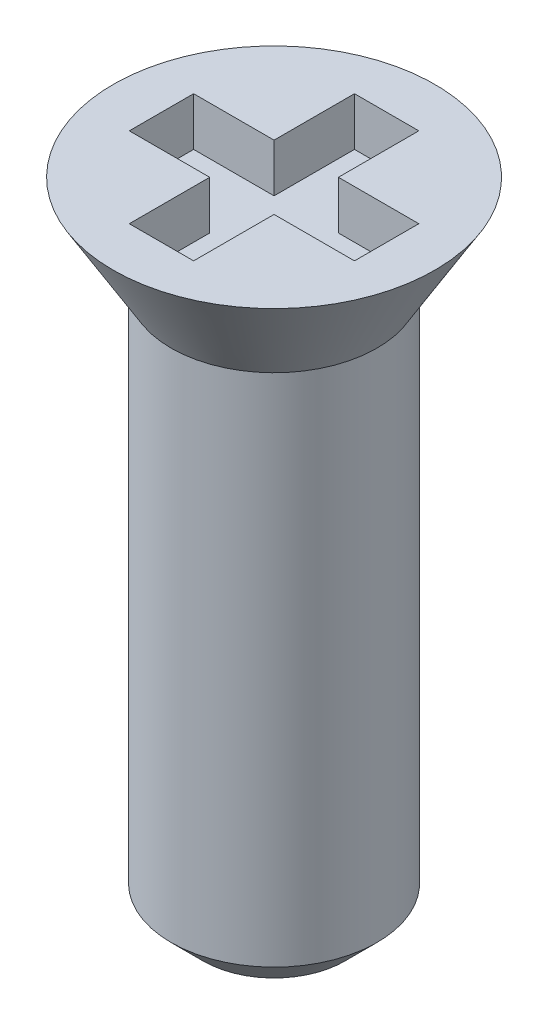
ISO-10303-21;
HEADER;
FILE_DESCRIPTION(('STEP AP214'),'2;1');
FILE_NAME('part.step','',(''),(''),'','','');
FILE_SCHEMA(('AUTOMOTIVE_DESIGN { 1 0 10303 214 1 1 1 1 }'));
ENDSEC;
DATA;
#1=APPLICATION_CONTEXT('core data for automotive mechanical design processes');
#2=APPLICATION_PROTOCOL_DEFINITION('international standard','automotive_design',2000,#1);
#3=PRODUCT_CONTEXT('',#1,'mechanical');
#4=PRODUCT('Part','Part','',(#3));
#5=PRODUCT_RELATED_PRODUCT_CATEGORY('part','',(#4));
#6=PRODUCT_DEFINITION_FORMATION('','',#4);
#7=PRODUCT_DEFINITION_CONTEXT('part definition',#1,'design');
#8=PRODUCT_DEFINITION('design','',#6,#7);
#9=PRODUCT_DEFINITION_SHAPE('','',#8);
#10=(LENGTH_UNIT() NAMED_UNIT(*) SI_UNIT(.MILLI.,.METRE.));
#11=(NAMED_UNIT(*) PLANE_ANGLE_UNIT() SI_UNIT($,.RADIAN.));
#12=(NAMED_UNIT(*) SI_UNIT($,.STERADIAN.) SOLID_ANGLE_UNIT());
#13=UNCERTAINTY_MEASURE_WITH_UNIT(LENGTH_MEASURE(1.E-05),#10,'distance_accuracy_value','');
#14=(GEOMETRIC_REPRESENTATION_CONTEXT(3) GLOBAL_UNCERTAINTY_ASSIGNED_CONTEXT((#13)) GLOBAL_UNIT_ASSIGNED_CONTEXT((#10,
#11,#12)) REPRESENTATION_CONTEXT('',''));
#15=CARTESIAN_POINT('',(0.,0.,0.));
#16=DIRECTION('',(0.,0.,1.));
#17=DIRECTION('',(1.,0.,0.));
#18=AXIS2_PLACEMENT_3D('',#15,#16,#17);
#19=CARTESIAN_POINT('',(8.75000000000002,58.75,-7.50000000000001));
#20=DIRECTION('',(0.,1.,0.));
#21=DIRECTION('',(0.,0.,1.));
#22=AXIS2_PLACEMENT_3D('',#19,#20,#21);
#23=PLANE('',#22);
#24=DIRECTION('',(-1.,0.,0.));
#25=VECTOR('',#24,1.);
#26=CARTESIAN_POINT('',(8.75000000000002,58.75,-6.50000000000001));
#27=LINE('',#26,#25);
#28=CARTESIAN_POINT('',(8.75000000000002,58.75,-6.50000000000001));
#29=VERTEX_POINT('',#28);
#30=CARTESIAN_POINT('',(7.50000000000002,58.75,-6.50000000000001));
#31=VERTEX_POINT('',#30);
#32=EDGE_CURVE('E200',#29,#31,#27,.T.);
#33=ORIENTED_EDGE('',*,*,#32,.F.);
#34=DIRECTION('',(0.,0.,-1.));
#35=VECTOR('',#34,1.);
#36=CARTESIAN_POINT('',(8.75000000000002,58.75,-6.50000000000001));
#37=LINE('',#36,#35);
#38=CARTESIAN_POINT('',(8.75000000000002,58.75,-7.50000000000001));
#39=VERTEX_POINT('',#38);
#40=EDGE_CURVE('E208',#29,#39,#37,.T.);
#41=ORIENTED_EDGE('',*,*,#40,.T.);
#42=DIRECTION('',(-1.,0.,0.));
#43=VECTOR('',#42,1.);
#44=CARTESIAN_POINT('',(8.75000000000002,58.75,-7.50000000000001));
#45=LINE('',#44,#43);
#46=CARTESIAN_POINT('',(7.50000000000002,58.75,-7.50000000000001));
#47=VERTEX_POINT('',#46);
#48=EDGE_CURVE('E212',#39,#47,#45,.T.);
#49=ORIENTED_EDGE('',*,*,#48,.T.);
#50=DIRECTION('',(0.,0.,-1.));
#51=VECTOR('',#50,1.);
#52=CARTESIAN_POINT('',(7.50000000000002,58.75,-5.25000000000001));
#53=LINE('',#52,#51);
#54=CARTESIAN_POINT('',(7.50000000000002,58.75,-8.75000000000001));
#55=VERTEX_POINT('',#54);
#56=EDGE_CURVE('E102',#47,#55,#53,.T.);
#57=ORIENTED_EDGE('',*,*,#56,.T.);
#58=DIRECTION('',(-1.,0.,0.));
#59=VECTOR('',#58,1.);
#60=CARTESIAN_POINT('',(6.50000000000002,58.75,-8.75000000000001));
#61=LINE('',#60,#59);
#62=CARTESIAN_POINT('',(6.50000000000002,58.75,-8.75000000000001));
#63=VERTEX_POINT('',#62);
#64=EDGE_CURVE('E104',#55,#63,#61,.T.);
#65=ORIENTED_EDGE('',*,*,#64,.T.);
#66=DIRECTION('',(0.,0.,1.));
#67=VECTOR('',#66,1.);
#68=CARTESIAN_POINT('',(6.50000000000002,58.75,-5.25000000000001));
#69=LINE('',#68,#67);
#70=CARTESIAN_POINT('',(6.50000000000002,58.75,-7.50000000000001));
#71=VERTEX_POINT('',#70);
#72=EDGE_CURVE('E108',#63,#71,#69,.T.);
#73=ORIENTED_EDGE('',*,*,#72,.T.);
#74=DIRECTION('',(-1.,0.,0.));
#75=VECTOR('',#74,1.);
#76=CARTESIAN_POINT('',(8.75000000000002,58.75,-7.50000000000001));
#77=LINE('',#76,#75);
#78=CARTESIAN_POINT('',(5.25000000000002,58.75,-7.50000000000001));
#79=VERTEX_POINT('',#78);
#80=EDGE_CURVE('E173',#71,#79,#77,.T.);
#81=ORIENTED_EDGE('',*,*,#80,.T.);
#82=DIRECTION('',(0.,0.,1.));
#83=VECTOR('',#82,1.);
#84=CARTESIAN_POINT('',(5.25000000000002,58.75,-6.50000000000001));
#85=LINE('',#84,#83);
#86=CARTESIAN_POINT('',(5.25000000000002,58.75,-6.50000000000001));
#87=VERTEX_POINT('',#86);
#88=EDGE_CURVE('E178',#87,#79,#85,.F.);
#89=ORIENTED_EDGE('',*,*,#88,.F.);
#90=DIRECTION('',(-1.,0.,0.));
#91=VECTOR('',#90,1.);
#92=CARTESIAN_POINT('',(8.75000000000002,58.75,-6.50000000000001));
#93=LINE('',#92,#91);
#94=CARTESIAN_POINT('',(6.50000000000002,58.75,-6.50000000000001));
#95=VERTEX_POINT('',#94);
#96=EDGE_CURVE('E183',#95,#87,#93,.T.);
#97=ORIENTED_EDGE('',*,*,#96,.F.);
#98=DIRECTION('',(0.,0.,1.));
#99=VECTOR('',#98,1.);
#100=CARTESIAN_POINT('',(6.50000000000002,58.75,-5.25000000000001));
#101=LINE('',#100,#99);
#102=CARTESIAN_POINT('',(6.50000000000002,58.75,-5.25000000000001));
#103=VERTEX_POINT('',#102);
#104=EDGE_CURVE('E190',#95,#103,#101,.T.);
#105=ORIENTED_EDGE('',*,*,#104,.T.);
#106=DIRECTION('',(1.,0.,0.));
#107=VECTOR('',#106,1.);
#108=CARTESIAN_POINT('',(6.50000000000002,58.75,-5.25000000000001));
#109=LINE('',#108,#107);
#110=CARTESIAN_POINT('',(7.50000000000002,58.75,-5.25000000000001));
#111=VERTEX_POINT('',#110);
#112=EDGE_CURVE('E194',#103,#111,#109,.T.);
#113=ORIENTED_EDGE('',*,*,#112,.T.);
#114=DIRECTION('',(0.,0.,-1.));
#115=VECTOR('',#114,1.);
#116=CARTESIAN_POINT('',(7.50000000000002,58.75,-5.25000000000001));
#117=LINE('',#116,#115);
#118=EDGE_CURVE('E198',#111,#31,#117,.T.);
#119=ORIENTED_EDGE('',*,*,#118,.T.);
#120=EDGE_LOOP('',(#33,#41,#49,#57,#65,#73,#81,#89,#97,#105,#113,#119));
#121=FACE_BOUND('',#120,.T.);
#122=ADVANCED_FACE('F16',(#121),#23,.T.);
#123=CARTESIAN_POINT('',(6.50000000000002,58.75,-5.25000000000001));
#124=DIRECTION('',(-1.,0.,0.));
#125=DIRECTION('',(0.,-1.,0.));
#126=AXIS2_PLACEMENT_3D('',#123,#124,#125);
#127=PLANE('',#126);
#128=DIRECTION('',(0.,1.,0.));
#129=VECTOR('',#128,1.);
#130=CARTESIAN_POINT('',(6.50000000000002,58.75,-8.75000000000001));
#131=LINE('',#130,#129);
#132=CARTESIAN_POINT('',(6.50000000000002,59.5,-8.75000000000001));
#133=VERTEX_POINT('',#132);
#134=EDGE_CURVE('E113',#63,#133,#131,.T.);
#135=ORIENTED_EDGE('',*,*,#134,.T.);
#136=DIRECTION('',(0.,0.,1.));
#137=VECTOR('',#136,1.);
#138=CARTESIAN_POINT('',(6.50000000000002,59.5,-7.00000000000001));
#139=LINE('',#138,#137);
#140=CARTESIAN_POINT('',(6.50000000000002,59.5,-7.50000000000001));
#141=VERTEX_POINT('',#140);
#142=EDGE_CURVE('E172',#141,#133,#139,.F.);
#143=ORIENTED_EDGE('',*,*,#142,.F.);
#144=DIRECTION('',(0.,1.,0.));
#145=VECTOR('',#144,1.);
#146=CARTESIAN_POINT('',(6.50000000000002,58.75,-7.50000000000001));
#147=LINE('',#146,#145);
#148=EDGE_CURVE('E119',#141,#71,#147,.F.);
#149=ORIENTED_EDGE('',*,*,#148,.T.);
#150=ORIENTED_EDGE('',*,*,#72,.F.);
#151=EDGE_LOOP('',(#135,#143,#149,#150));
#152=FACE_BOUND('',#151,.T.);
#153=ADVANCED_FACE('F116',(#152),#127,.F.);
#154=CARTESIAN_POINT('',(6.50000000000002,58.75,-8.75000000000001));
#155=DIRECTION('',(0.,0.,-1.));
#156=DIRECTION('',(-1.,0.,0.));
#157=AXIS2_PLACEMENT_3D('',#154,#155,#156);
#158=PLANE('',#157);
#159=ORIENTED_EDGE('',*,*,#134,.F.);
#160=ORIENTED_EDGE('',*,*,#64,.F.);
#161=DIRECTION('',(0.,1.,0.));
#162=VECTOR('',#161,1.);
#163=CARTESIAN_POINT('',(7.50000000000002,58.75,-8.75000000000001));
#164=LINE('',#163,#162);
#165=CARTESIAN_POINT('',(7.50000000000002,59.5,-8.75000000000001));
#166=VERTEX_POINT('',#165);
#167=EDGE_CURVE('E127',#55,#166,#164,.T.);
#168=ORIENTED_EDGE('',*,*,#167,.T.);
#169=DIRECTION('',(1.,0.,0.));
#170=VECTOR('',#169,1.);
#171=CARTESIAN_POINT('',(7.00000000000002,59.5,-8.75000000000001));
#172=LINE('',#171,#170);
#173=EDGE_CURVE('E124',#133,#166,#172,.T.);
#174=ORIENTED_EDGE('',*,*,#173,.F.);
#175=EDGE_LOOP('',(#159,#160,#168,#174));
#176=FACE_BOUND('',#175,.T.);
#177=ADVANCED_FACE('F122',(#176),#158,.F.);
#178=CARTESIAN_POINT('',(7.50000000000002,58.75,-5.25000000000001));
#179=DIRECTION('',(1.,0.,0.));
#180=DIRECTION('',(0.,0.,-1.));
#181=AXIS2_PLACEMENT_3D('',#178,#179,#180);
#182=PLANE('',#181);
#183=ORIENTED_EDGE('',*,*,#167,.F.);
#184=ORIENTED_EDGE('',*,*,#56,.F.);
#185=DIRECTION('',(0.,1.,0.));
#186=VECTOR('',#185,1.);
#187=CARTESIAN_POINT('',(7.50000000000002,58.75,-7.50000000000001));
#188=LINE('',#187,#186);
#189=CARTESIAN_POINT('',(7.50000000000002,59.5,-7.50000000000001));
#190=VERTEX_POINT('',#189);
#191=EDGE_CURVE('E210',#47,#190,#188,.T.);
#192=ORIENTED_EDGE('',*,*,#191,.T.);
#193=DIRECTION('',(0.,0.,1.));
#194=VECTOR('',#193,1.);
#195=CARTESIAN_POINT('',(7.50000000000002,59.5,-7.00000000000001));
#196=LINE('',#195,#194);
#197=EDGE_CURVE('E168',#166,#190,#196,.T.);
#198=ORIENTED_EDGE('',*,*,#197,.F.);
#199=EDGE_LOOP('',(#183,#184,#192,#198));
#200=FACE_BOUND('',#199,.T.);
#201=ADVANCED_FACE('F215',(#200),#182,.F.);
#202=CARTESIAN_POINT('',(8.75000000000002,58.75,-7.50000000000001));
#203=DIRECTION('',(0.,0.,-1.));
#204=DIRECTION('',(-1.,0.,0.));
#205=AXIS2_PLACEMENT_3D('',#202,#203,#204);
#206=PLANE('',#205);
#207=ORIENTED_EDGE('',*,*,#191,.F.);
#208=ORIENTED_EDGE('',*,*,#48,.F.);
#209=DIRECTION('',(0.,1.,0.));
#210=VECTOR('',#209,1.);
#211=CARTESIAN_POINT('',(8.75000000000002,58.75,-7.50000000000001));
#212=LINE('',#211,#210);
#213=CARTESIAN_POINT('',(8.75000000000002,59.5,-7.50000000000001));
#214=VERTEX_POINT('',#213);
#215=EDGE_CURVE('E206',#39,#214,#212,.T.);
#216=ORIENTED_EDGE('',*,*,#215,.T.);
#217=DIRECTION('',(1.,0.,0.));
#218=VECTOR('',#217,1.);
#219=CARTESIAN_POINT('',(7.00000000000002,59.5,-7.50000000000001));
#220=LINE('',#219,#218);
#221=EDGE_CURVE('E165',#190,#214,#220,.T.);
#222=ORIENTED_EDGE('',*,*,#221,.F.);
#223=EDGE_LOOP('',(#207,#208,#216,#222));
#224=FACE_BOUND('',#223,.T.);
#225=ADVANCED_FACE('F251',(#224),#206,.F.);
#226=CARTESIAN_POINT('',(8.75000000000002,58.75,-6.50000000000001));
#227=DIRECTION('',(1.,0.,0.));
#228=DIRECTION('',(0.,0.,-1.));
#229=AXIS2_PLACEMENT_3D('',#226,#227,#228);
#230=PLANE('',#229);
#231=ORIENTED_EDGE('',*,*,#215,.F.);
#232=ORIENTED_EDGE('',*,*,#40,.F.);
#233=DIRECTION('',(0.,1.,0.));
#234=VECTOR('',#233,1.);
#235=CARTESIAN_POINT('',(8.75000000000002,58.75,-6.50000000000001));
#236=LINE('',#235,#234);
#237=CARTESIAN_POINT('',(8.75000000000002,59.5,-6.50000000000001));
#238=VERTEX_POINT('',#237);
#239=EDGE_CURVE('E203',#238,#29,#236,.F.);
#240=ORIENTED_EDGE('',*,*,#239,.F.);
#241=DIRECTION('',(0.,0.,1.));
#242=VECTOR('',#241,1.);
#243=CARTESIAN_POINT('',(8.75000000000002,59.5,-7.00000000000001));
#244=LINE('',#243,#242);
#245=EDGE_CURVE('E162',#214,#238,#244,.T.);
#246=ORIENTED_EDGE('',*,*,#245,.F.);
#247=EDGE_LOOP('',(#231,#232,#240,#246));
#248=FACE_BOUND('',#247,.T.);
#249=ADVANCED_FACE('F248',(#248),#230,.F.);
#250=CARTESIAN_POINT('',(8.75000000000002,58.75,-6.50000000000001));
#251=DIRECTION('',(0.,0.,-1.));
#252=DIRECTION('',(-1.,0.,0.));
#253=AXIS2_PLACEMENT_3D('',#250,#251,#252);
#254=PLANE('',#253);
#255=ORIENTED_EDGE('',*,*,#239,.T.);
#256=ORIENTED_EDGE('',*,*,#32,.T.);
#257=DIRECTION('',(0.,1.,0.));
#258=VECTOR('',#257,1.);
#259=CARTESIAN_POINT('',(7.50000000000002,58.75,-6.50000000000001));
#260=LINE('',#259,#258);
#261=CARTESIAN_POINT('',(7.50000000000002,59.5,-6.50000000000001));
#262=VERTEX_POINT('',#261);
#263=EDGE_CURVE('E196',#31,#262,#260,.T.);
#264=ORIENTED_EDGE('',*,*,#263,.T.);
#265=DIRECTION('',(1.,0.,0.));
#266=VECTOR('',#265,1.);
#267=CARTESIAN_POINT('',(7.00000000000002,59.5,-6.50000000000001));
#268=LINE('',#267,#266);
#269=EDGE_CURVE('E159',#238,#262,#268,.F.);
#270=ORIENTED_EDGE('',*,*,#269,.F.);
#271=EDGE_LOOP('',(#255,#256,#264,#270));
#272=FACE_BOUND('',#271,.T.);
#273=ADVANCED_FACE('F243',(#272),#254,.T.);
#274=CARTESIAN_POINT('',(7.50000000000002,58.75,-5.25000000000001));
#275=DIRECTION('',(1.,0.,0.));
#276=DIRECTION('',(0.,0.,-1.));
#277=AXIS2_PLACEMENT_3D('',#274,#275,#276);
#278=PLANE('',#277);
#279=ORIENTED_EDGE('',*,*,#118,.F.);
#280=DIRECTION('',(0.,1.,0.));
#281=VECTOR('',#280,1.);
#282=CARTESIAN_POINT('',(7.50000000000002,58.75,-5.25000000000001));
#283=LINE('',#282,#281);
#284=CARTESIAN_POINT('',(7.50000000000002,59.5,-5.25000000000001));
#285=VERTEX_POINT('',#284);
#286=EDGE_CURVE('E192',#111,#285,#283,.T.);
#287=ORIENTED_EDGE('',*,*,#286,.T.);
#288=DIRECTION('',(0.,0.,1.));
#289=VECTOR('',#288,1.);
#290=CARTESIAN_POINT('',(7.50000000000002,59.5,-7.00000000000001));
#291=LINE('',#290,#289);
#292=EDGE_CURVE('E156',#262,#285,#291,.T.);
#293=ORIENTED_EDGE('',*,*,#292,.F.);
#294=ORIENTED_EDGE('',*,*,#263,.F.);
#295=EDGE_LOOP('',(#279,#287,#293,#294));
#296=FACE_BOUND('',#295,.T.);
#297=ADVANCED_FACE('F240',(#296),#278,.F.);
#298=CARTESIAN_POINT('',(6.50000000000002,58.75,-5.25000000000001));
#299=DIRECTION('',(0.,0.,1.));
#300=DIRECTION('',(1.,0.,0.));
#301=AXIS2_PLACEMENT_3D('',#298,#299,#300);
#302=PLANE('',#301);
#303=ORIENTED_EDGE('',*,*,#286,.F.);
#304=ORIENTED_EDGE('',*,*,#112,.F.);
#305=DIRECTION('',(0.,-1.,0.));
#306=VECTOR('',#305,1.);
#307=CARTESIAN_POINT('',(6.50000000000002,58.75,-5.25000000000001));
#308=LINE('',#307,#306);
#309=CARTESIAN_POINT('',(6.50000000000002,59.5,-5.25000000000001));
#310=VERTEX_POINT('',#309);
#311=EDGE_CURVE('E188',#103,#310,#308,.F.);
#312=ORIENTED_EDGE('',*,*,#311,.T.);
#313=DIRECTION('',(1.,0.,0.));
#314=VECTOR('',#313,1.);
#315=CARTESIAN_POINT('',(7.00000000000002,59.5,-5.25000000000001));
#316=LINE('',#315,#314);
#317=EDGE_CURVE('E153',#285,#310,#316,.F.);
#318=ORIENTED_EDGE('',*,*,#317,.F.);
#319=EDGE_LOOP('',(#303,#304,#312,#318));
#320=FACE_BOUND('',#319,.T.);
#321=ADVANCED_FACE('F236',(#320),#302,.F.);
#322=CARTESIAN_POINT('',(6.50000000000002,58.75,-5.25000000000001));
#323=DIRECTION('',(-1.,0.,0.));
#324=DIRECTION('',(0.,-1.,0.));
#325=AXIS2_PLACEMENT_3D('',#322,#323,#324);
#326=PLANE('',#325);
#327=DIRECTION('',(0.,0.,1.));
#328=VECTOR('',#327,1.);
#329=CARTESIAN_POINT('',(6.50000000000002,59.5,-7.00000000000001));
#330=LINE('',#329,#328);
#331=CARTESIAN_POINT('',(6.50000000000002,59.5,-6.50000000000001));
#332=VERTEX_POINT('',#331);
#333=EDGE_CURVE('E150',#310,#332,#330,.F.);
#334=ORIENTED_EDGE('',*,*,#333,.F.);
#335=ORIENTED_EDGE('',*,*,#311,.F.);
#336=ORIENTED_EDGE('',*,*,#104,.F.);
#337=DIRECTION('',(0.,1.,0.));
#338=VECTOR('',#337,1.);
#339=CARTESIAN_POINT('',(6.50000000000002,58.75,-6.50000000000001));
#340=LINE('',#339,#338);
#341=EDGE_CURVE('E185',#332,#95,#340,.F.);
#342=ORIENTED_EDGE('',*,*,#341,.F.);
#343=EDGE_LOOP('',(#334,#335,#336,#342));
#344=FACE_BOUND('',#343,.T.);
#345=ADVANCED_FACE('F230',(#344),#326,.F.);
#346=CARTESIAN_POINT('',(8.75000000000002,58.75,-6.50000000000001));
#347=DIRECTION('',(0.,0.,-1.));
#348=DIRECTION('',(-1.,0.,0.));
#349=AXIS2_PLACEMENT_3D('',#346,#347,#348);
#350=PLANE('',#349);
#351=DIRECTION('',(0.,1.,0.));
#352=VECTOR('',#351,1.);
#353=CARTESIAN_POINT('',(5.25000000000002,58.75,-6.50000000000001));
#354=LINE('',#353,#352);
#355=CARTESIAN_POINT('',(5.25000000000002,59.5,-6.50000000000001));
#356=VERTEX_POINT('',#355);
#357=EDGE_CURVE('E180',#356,#87,#354,.F.);
#358=ORIENTED_EDGE('',*,*,#357,.F.);
#359=DIRECTION('',(1.,0.,0.));
#360=VECTOR('',#359,1.);
#361=CARTESIAN_POINT('',(7.00000000000002,59.5,-6.50000000000001));
#362=LINE('',#361,#360);
#363=EDGE_CURVE('E145',#332,#356,#362,.F.);
#364=ORIENTED_EDGE('',*,*,#363,.F.);
#365=ORIENTED_EDGE('',*,*,#341,.T.);
#366=ORIENTED_EDGE('',*,*,#96,.T.);
#367=EDGE_LOOP('',(#358,#364,#365,#366));
#368=FACE_BOUND('',#367,.T.);
#369=ADVANCED_FACE('F227',(#368),#350,.T.);
#370=CARTESIAN_POINT('',(5.25000000000002,58.75,-6.50000000000001));
#371=DIRECTION('',(1.,0.,0.));
#372=DIRECTION('',(0.,1.,0.));
#373=AXIS2_PLACEMENT_3D('',#370,#371,#372);
#374=PLANE('',#373);
#375=ORIENTED_EDGE('',*,*,#88,.T.);
#376=DIRECTION('',(0.,1.,0.));
#377=VECTOR('',#376,1.);
#378=CARTESIAN_POINT('',(5.25000000000002,58.75,-7.50000000000001));
#379=LINE('',#378,#377);
#380=CARTESIAN_POINT('',(5.25000000000002,59.5,-7.50000000000001));
#381=VERTEX_POINT('',#380);
#382=EDGE_CURVE('E34',#79,#381,#379,.T.);
#383=ORIENTED_EDGE('',*,*,#382,.T.);
#384=DIRECTION('',(0.,0.,1.));
#385=VECTOR('',#384,1.);
#386=CARTESIAN_POINT('',(5.25000000000002,59.5,-7.00000000000001));
#387=LINE('',#386,#385);
#388=EDGE_CURVE('E141',#356,#381,#387,.F.);
#389=ORIENTED_EDGE('',*,*,#388,.F.);
#390=ORIENTED_EDGE('',*,*,#357,.T.);
#391=EDGE_LOOP('',(#375,#383,#389,#390));
#392=FACE_BOUND('',#391,.T.);
#393=ADVANCED_FACE('F224',(#392),#374,.T.);
#394=CARTESIAN_POINT('',(8.75000000000002,58.75,-7.50000000000001));
#395=DIRECTION('',(0.,0.,-1.));
#396=DIRECTION('',(-1.,0.,0.));
#397=AXIS2_PLACEMENT_3D('',#394,#395,#396);
#398=PLANE('',#397);
#399=ORIENTED_EDGE('',*,*,#148,.F.);
#400=DIRECTION('',(1.,0.,0.));
#401=VECTOR('',#400,1.);
#402=CARTESIAN_POINT('',(7.00000000000002,59.5,-7.50000000000001));
#403=LINE('',#402,#401);
#404=EDGE_CURVE('E137',#381,#141,#403,.T.);
#405=ORIENTED_EDGE('',*,*,#404,.F.);
#406=ORIENTED_EDGE('',*,*,#382,.F.);
#407=ORIENTED_EDGE('',*,*,#80,.F.);
#408=EDGE_LOOP('',(#399,#405,#406,#407));
#409=FACE_BOUND('',#408,.T.);
#410=ADVANCED_FACE('F221',(#409),#398,.F.);
#411=CARTESIAN_POINT('',(7.00000000000002,59.5,-7.00000000000001));
#412=DIRECTION('',(0.,1.,0.));
#413=DIRECTION('',(0.,0.,1.));
#414=AXIS2_PLACEMENT_3D('',#411,#412,#413);
#415=PLANE('',#414);
#416=ORIENTED_EDGE('',*,*,#388,.T.);
#417=ORIENTED_EDGE('',*,*,#404,.T.);
#418=ORIENTED_EDGE('',*,*,#142,.T.);
#419=ORIENTED_EDGE('',*,*,#173,.T.);
#420=ORIENTED_EDGE('',*,*,#197,.T.);
#421=ORIENTED_EDGE('',*,*,#221,.T.);
#422=ORIENTED_EDGE('',*,*,#245,.T.);
#423=ORIENTED_EDGE('',*,*,#269,.T.);
#424=ORIENTED_EDGE('',*,*,#292,.T.);
#425=ORIENTED_EDGE('',*,*,#317,.T.);
#426=ORIENTED_EDGE('',*,*,#333,.T.);
#427=ORIENTED_EDGE('',*,*,#363,.T.);
#428=EDGE_LOOP('',(#416,#417,#418,#419,#420,#421,#422,#423,#424,#425,#426,#427));
#429=FACE_BOUND('',#428,.T.);
#430=CARTESIAN_POINT('',(7.00000000000002,59.4999999999573,-7.00000000000001));
#431=DIRECTION('',(0.,1.,0.));
#432=DIRECTION('',(0.,0.,1.));
#433=AXIS2_PLACEMENT_3D('',#430,#431,#432);
#434=CIRCLE('',#433,2.49999999998137);
#435=CARTESIAN_POINT('',(7.00000000000002,59.4999999999572,-4.50000000001863));
#436=VERTEX_POINT('',#435);
#437=EDGE_CURVE('E19',#436,#436,#434,.F.);
#438=ORIENTED_EDGE('',*,*,#437,.F.);
#439=EDGE_LOOP('',(#438));
#440=FACE_BOUND('',#439,.T.);
#441=ADVANCED_FACE('F218',(#429,#440),#415,.T.);
#442=CARTESIAN_POINT('',(8.60000000000002,49.5,-7.00000000000001));
#443=DIRECTION('',(0.,-1.,0.));
#444=DIRECTION('',(1.,0.,0.));
#445=AXIS2_PLACEMENT_3D('',#442,#443,#444);
#446=PLANE('',#445);
#447=CARTESIAN_POINT('',(7.00000000000002,49.5000000000232,-7.00000000000001));
#448=DIRECTION('',(0.,1.,0.));
#449=DIRECTION('',(0.,0.,1.));
#450=AXIS2_PLACEMENT_3D('',#447,#448,#449);
#451=CIRCLE('',#450,1.10000000005996);
#452=CARTESIAN_POINT('',(7.00000000000002,49.5000000000232,-5.89999999994005));
#453=VERTEX_POINT('',#452);
#454=EDGE_CURVE('E130',#453,#453,#451,.T.);
#455=ORIENTED_EDGE('',*,*,#454,.F.);
#456=EDGE_LOOP('',(#455));
#457=FACE_BOUND('',#456,.T.);
#458=ADVANCED_FACE('F276',(#457),#446,.T.);
#459=CARTESIAN_POINT('',(7.00000000000002,59.4999999997867,-7.00000000000001));
#460=DIRECTION('',(0.,1.,0.));
#461=DIRECTION('',(0.,0.,1.));
#462=AXIS2_PLACEMENT_3D('',#459,#460,#461);
#463=CONICAL_SURFACE('',#462,2.49999999987905,0.540419500253865);
#464=CARTESIAN_POINT('',(7.00000000000002,58.,-7.00000000000001));
#465=DIRECTION('',(0.,1.,0.));
#466=DIRECTION('',(0.,0.,1.));
#467=AXIS2_PLACEMENT_3D('',#464,#465,#466);
#468=CIRCLE('',#467,1.6);
#469=CARTESIAN_POINT('',(7.00000000000002,58.,-5.40000000000001));
#470=VERTEX_POINT('',#469);
#471=EDGE_CURVE('E25',#470,#470,#468,.F.);
#472=ORIENTED_EDGE('',*,*,#471,.F.);
#473=EDGE_LOOP('',(#472));
#474=FACE_BOUND('',#473,.T.);
#475=ORIENTED_EDGE('',*,*,#437,.T.);
#476=EDGE_LOOP('',(#475));
#477=FACE_BOUND('',#476,.T.);
#478=ADVANCED_FACE('F269',(#474,#477),#463,.T.);
#479=CARTESIAN_POINT('',(7.00000000000002,50.0000000000682,-7.00000000000001));
#480=DIRECTION('',(0.,1.,0.));
#481=DIRECTION('',(0.,0.,1.));
#482=AXIS2_PLACEMENT_3D('',#479,#480,#481);
#483=CONICAL_SURFACE('',#482,1.60000000004813,0.785398163340605);
#484=CARTESIAN_POINT('',(7.00000000000002,50.,-7.00000000000001));
#485=DIRECTION('',(0.,1.,0.));
#486=DIRECTION('',(0.,0.,1.));
#487=AXIS2_PLACEMENT_3D('',#484,#485,#486);
#488=CIRCLE('',#487,1.6);
#489=CARTESIAN_POINT('',(7.00000000000002,50.,-5.40000000000001));
#490=VERTEX_POINT('',#489);
#491=EDGE_CURVE('E11',#490,#490,#488,.T.);
#492=ORIENTED_EDGE('',*,*,#491,.F.);
#493=EDGE_LOOP('',(#492));
#494=FACE_BOUND('',#493,.T.);
#495=ORIENTED_EDGE('',*,*,#454,.T.);
#496=EDGE_LOOP('',(#495));
#497=FACE_BOUND('',#496,.T.);
#498=ADVANCED_FACE('F263',(#494,#497),#483,.T.);
#499=CARTESIAN_POINT('',(7.00000000000002,49.5,-7.00000000000001));
#500=DIRECTION('',(0.,1.,0.));
#501=DIRECTION('',(0.,0.,1.));
#502=AXIS2_PLACEMENT_3D('',#499,#500,#501);
#503=CYLINDRICAL_SURFACE('',#502,1.6);
#504=ORIENTED_EDGE('',*,*,#471,.T.);
#505=EDGE_LOOP('',(#504));
#506=FACE_BOUND('',#505,.T.);
#507=ORIENTED_EDGE('',*,*,#491,.T.);
#508=EDGE_LOOP('',(#507));
#509=FACE_BOUND('',#508,.T.);
#510=ADVANCED_FACE('F261',(#506,#509),#503,.T.);
#511=CLOSED_SHELL('',(#122,#153,#177,#201,#225,#249,#273,#297,#321,#345,#369,#393,#410,#441,
#458,#478,#498,#510));
#512=MANIFOLD_SOLID_BREP('B1',#511);
#513=ADVANCED_BREP_SHAPE_REPRESENTATION('',(#18,#512),#14);
#514=SHAPE_DEFINITION_REPRESENTATION(#9,#513);
ENDSEC;
END-ISO-10303-21;
